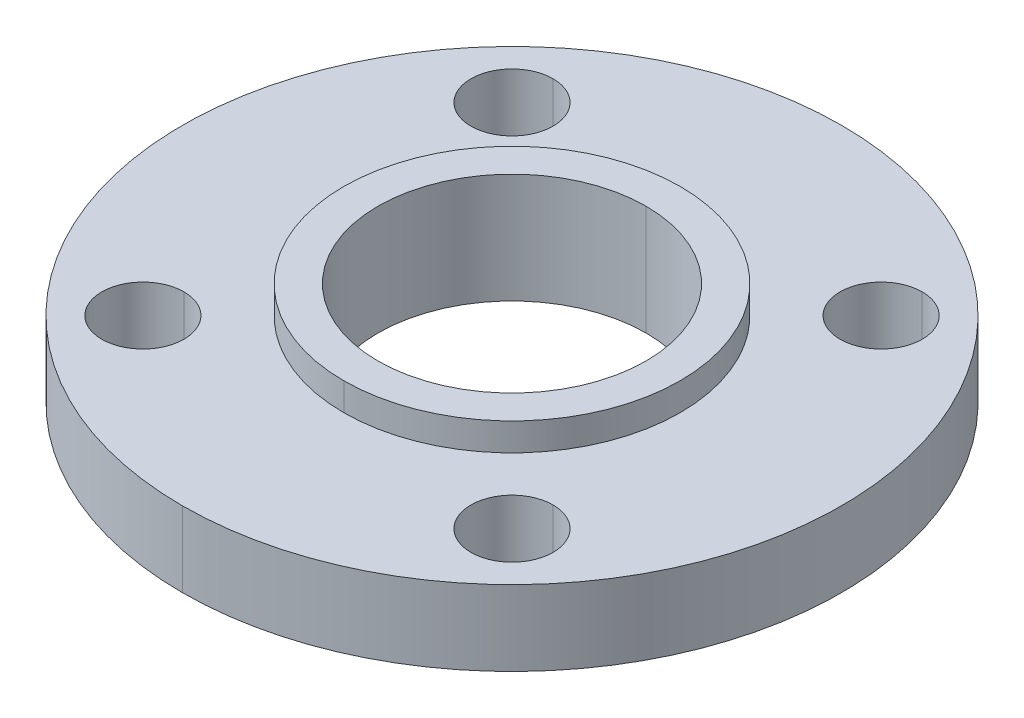
ISO-10303-21;
HEADER;
FILE_DESCRIPTION(('STEP AP214'),'2;1');
FILE_NAME('part.step','',(''),(''),'','','');
FILE_SCHEMA(('AUTOMOTIVE_DESIGN { 1 0 10303 214 1 1 1 1 }'));
ENDSEC;
DATA;
#1=APPLICATION_CONTEXT('core data for automotive mechanical design processes');
#2=APPLICATION_PROTOCOL_DEFINITION('international standard','automotive_design',2000,#1);
#3=PRODUCT_CONTEXT('',#1,'mechanical');
#4=PRODUCT('Part','Part','',(#3));
#5=PRODUCT_RELATED_PRODUCT_CATEGORY('part','',(#4));
#6=PRODUCT_DEFINITION_FORMATION('','',#4);
#7=PRODUCT_DEFINITION_CONTEXT('part definition',#1,'design');
#8=PRODUCT_DEFINITION('design','',#6,#7);
#9=PRODUCT_DEFINITION_SHAPE('','',#8);
#10=(LENGTH_UNIT() NAMED_UNIT(*) SI_UNIT(.MILLI.,.METRE.));
#11=(NAMED_UNIT(*) PLANE_ANGLE_UNIT() SI_UNIT($,.RADIAN.));
#12=(NAMED_UNIT(*) SI_UNIT($,.STERADIAN.) SOLID_ANGLE_UNIT());
#13=UNCERTAINTY_MEASURE_WITH_UNIT(LENGTH_MEASURE(1.E-05),#10,'distance_accuracy_value','');
#14=(GEOMETRIC_REPRESENTATION_CONTEXT(3) GLOBAL_UNCERTAINTY_ASSIGNED_CONTEXT((#13)) GLOBAL_UNIT_ASSIGNED_CONTEXT((#10,
#11,#12)) REPRESENTATION_CONTEXT('',''));
#15=CARTESIAN_POINT('',(0.,0.,0.));
#16=DIRECTION('',(0.,0.,1.));
#17=DIRECTION('',(1.,0.,0.));
#18=AXIS2_PLACEMENT_3D('',#15,#16,#17);
#19=CARTESIAN_POINT('',(-42.6738942446084,-12.7,-42.6738942446082));
#20=DIRECTION('',(0.,1.,0.));
#21=DIRECTION('',(0.,0.,1.));
#22=AXIS2_PLACEMENT_3D('',#19,#20,#21);
#23=CYLINDRICAL_SURFACE('',#22,9.5);
#24=DIRECTION('',(0.,1.,0.));
#25=VECTOR('',#24,1.);
#26=CARTESIAN_POINT('',(-42.6738942446083,-12.7,-52.1738942446082));
#27=LINE('',#26,#25);
#28=CARTESIAN_POINT('',(-42.6738942446084,-11.1,-52.1738942446086));
#29=VERTEX_POINT('',#28);
#30=CARTESIAN_POINT('',(-42.6738942446084,6.29999999999953,-52.1738942446076));
#31=VERTEX_POINT('',#30);
#32=EDGE_CURVE('E329',#29,#31,#27,.T.);
#33=ORIENTED_EDGE('',*,*,#32,.F.);
#34=CARTESIAN_POINT('',(-42.6738942446082,-11.1,-42.6738942446086));
#35=DIRECTION('',(0.,1.,0.));
#36=DIRECTION('',(0.,0.,1.));
#37=AXIS2_PLACEMENT_3D('',#34,#35,#36);
#38=CIRCLE('',#37,9.5);
#39=CARTESIAN_POINT('',(-42.6738942446083,-11.1,-33.1738942446086));
#40=VERTEX_POINT('',#39);
#41=EDGE_CURVE('E235',#40,#29,#38,.T.);
#42=ORIENTED_EDGE('',*,*,#41,.F.);
#43=DIRECTION('',(0.,1.,0.));
#44=VECTOR('',#43,1.);
#45=CARTESIAN_POINT('',(-42.6738942446084,-12.7,-33.1738942446082));
#46=LINE('',#45,#44);
#47=CARTESIAN_POINT('',(-42.6738942446084,6.29999999999953,-33.1738942446075));
#48=VERTEX_POINT('',#47);
#49=EDGE_CURVE('E249',#40,#48,#46,.T.);
#50=ORIENTED_EDGE('',*,*,#49,.T.);
#51=CARTESIAN_POINT('',(-42.6738942446082,6.29999999999953,-42.6738942446075));
#52=DIRECTION('',(0.,1.,0.));
#53=DIRECTION('',(1.,0.,0.));
#54=AXIS2_PLACEMENT_3D('',#51,#52,#53);
#55=CIRCLE('',#54,9.5);
#56=EDGE_CURVE('E240',#48,#31,#55,.T.);
#57=ORIENTED_EDGE('',*,*,#56,.T.);
#58=EDGE_LOOP('',(#33,#42,#50,#57));
#59=FACE_BOUND('',#58,.T.);
#60=ADVANCED_FACE('F17',(#59),#23,.F.);
#61=CARTESIAN_POINT('',(-42.6738942446078,-12.6999999999997,42.6738942446077));
#62=DIRECTION('',(0.,1.,0.));
#63=DIRECTION('',(0.,0.,1.));
#64=AXIS2_PLACEMENT_3D('',#61,#62,#63);
#65=CYLINDRICAL_SURFACE('',#64,9.5);
#66=DIRECTION('',(0.,1.,0.));
#67=VECTOR('',#66,1.);
#68=CARTESIAN_POINT('',(-42.6738942446078,-12.6999999999997,33.1738942446077));
#69=LINE('',#68,#67);
#70=CARTESIAN_POINT('',(-42.6738942446078,-11.0999999999999,33.1738942446075));
#71=VERTEX_POINT('',#70);
#72=CARTESIAN_POINT('',(-42.6738942446078,6.30000000000009,33.1738942446086));
#73=VERTEX_POINT('',#72);
#74=EDGE_CURVE('E207',#71,#73,#69,.T.);
#75=ORIENTED_EDGE('',*,*,#74,.F.);
#76=CARTESIAN_POINT('',(-42.6738942446078,-11.1,42.6738942446075));
#77=DIRECTION('',(0.,1.,0.));
#78=DIRECTION('',(0.,0.,1.));
#79=AXIS2_PLACEMENT_3D('',#76,#77,#78);
#80=CIRCLE('',#79,9.5);
#81=CARTESIAN_POINT('',(-42.6738942446078,-11.0999999999999,52.1738942446076));
#82=VERTEX_POINT('',#81);
#83=EDGE_CURVE('E320',#82,#71,#80,.T.);
#84=ORIENTED_EDGE('',*,*,#83,.F.);
#85=DIRECTION('',(0.,1.,0.));
#86=VECTOR('',#85,1.);
#87=CARTESIAN_POINT('',(-42.6738942446078,-12.6999999999997,52.1738942446077));
#88=LINE('',#87,#86);
#89=CARTESIAN_POINT('',(-42.6738942446078,6.30000000000008,52.1738942446086));
#90=VERTEX_POINT('',#89);
#91=EDGE_CURVE('E263',#82,#90,#88,.T.);
#92=ORIENTED_EDGE('',*,*,#91,.T.);
#93=CARTESIAN_POINT('',(-42.6738942446079,6.30000000000008,42.6738942446086));
#94=DIRECTION('',(0.,1.,0.));
#95=DIRECTION('',(0.,0.,-1.));
#96=AXIS2_PLACEMENT_3D('',#93,#94,#95);
#97=CIRCLE('',#96,9.5);
#98=EDGE_CURVE('E236',#90,#73,#97,.T.);
#99=ORIENTED_EDGE('',*,*,#98,.T.);
#100=EDGE_LOOP('',(#75,#84,#92,#99));
#101=FACE_BOUND('',#100,.T.);
#102=ADVANCED_FACE('F375',(#101),#65,.F.);
#103=CARTESIAN_POINT('',(42.6738942446087,-12.7000000000002,42.6738942446082));
#104=DIRECTION('',(0.,1.,0.));
#105=DIRECTION('',(0.,0.,1.));
#106=AXIS2_PLACEMENT_3D('',#103,#104,#105);
#107=CYLINDRICAL_SURFACE('',#106,9.5);
#108=DIRECTION('',(0.,1.,0.));
#109=VECTOR('',#108,1.);
#110=CARTESIAN_POINT('',(42.6738942446087,-12.7000000000002,33.1738942446082));
#111=LINE('',#110,#109);
#112=CARTESIAN_POINT('',(42.6738942446087,-11.1,33.1738942446083));
#113=VERTEX_POINT('',#112);
#114=CARTESIAN_POINT('',(42.6738942446087,6.30000000000031,33.1738942446083));
#115=VERTEX_POINT('',#114);
#116=EDGE_CURVE('E185',#113,#115,#111,.T.);
#117=ORIENTED_EDGE('',*,*,#116,.F.);
#118=CARTESIAN_POINT('',(42.6738942446087,-11.1,42.6738942446083));
#119=DIRECTION('',(0.,1.,0.));
#120=DIRECTION('',(0.,0.,1.));
#121=AXIS2_PLACEMENT_3D('',#118,#119,#120);
#122=CIRCLE('',#121,9.5);
#123=CARTESIAN_POINT('',(42.6738942446087,-11.1,52.1738942446083));
#124=VERTEX_POINT('',#123);
#125=EDGE_CURVE('E285',#124,#113,#122,.T.);
#126=ORIENTED_EDGE('',*,*,#125,.F.);
#127=DIRECTION('',(0.,1.,0.));
#128=VECTOR('',#127,1.);
#129=CARTESIAN_POINT('',(42.6738942446087,-12.7000000000001,52.1738942446082));
#130=LINE('',#129,#128);
#131=CARTESIAN_POINT('',(42.6738942446087,6.3000000000003,52.1738942446083));
#132=VERTEX_POINT('',#131);
#133=EDGE_CURVE('E226',#124,#132,#130,.T.);
#134=ORIENTED_EDGE('',*,*,#133,.T.);
#135=CARTESIAN_POINT('',(42.6738942446087,6.3000000000003,42.6738942446083));
#136=DIRECTION('',(0.,1.,0.));
#137=DIRECTION('',(-1.,0.,0.));
#138=AXIS2_PLACEMENT_3D('',#135,#136,#137);
#139=CIRCLE('',#138,9.5);
#140=EDGE_CURVE('E184',#132,#115,#139,.T.);
#141=ORIENTED_EDGE('',*,*,#140,.T.);
#142=EDGE_LOOP('',(#117,#126,#134,#141));
#143=FACE_BOUND('',#142,.T.);
#144=ADVANCED_FACE('F370',(#143),#107,.F.);
#145=CARTESIAN_POINT('',(42.6738942446079,-12.6999999999995,-42.6738942446074));
#146=DIRECTION('',(0.,1.,0.));
#147=DIRECTION('',(0.,0.,1.));
#148=AXIS2_PLACEMENT_3D('',#145,#146,#147);
#149=CYLINDRICAL_SURFACE('',#148,9.5);
#150=DIRECTION('',(0.,1.,0.));
#151=VECTOR('',#150,1.);
#152=CARTESIAN_POINT('',(42.6738942446079,-12.6999999999995,-52.1738942446073));
#153=LINE('',#152,#151);
#154=CARTESIAN_POINT('',(42.6738942446079,-11.0999999999994,-52.1738942446082));
#155=VERTEX_POINT('',#154);
#156=CARTESIAN_POINT('',(42.6738942446079,6.2999999999997,-52.1738942446079));
#157=VERTEX_POINT('',#156);
#158=EDGE_CURVE('E180',#155,#157,#153,.T.);
#159=ORIENTED_EDGE('',*,*,#158,.F.);
#160=CARTESIAN_POINT('',(42.6738942446079,-11.0999999999994,-42.6738942446082));
#161=DIRECTION('',(0.,1.,0.));
#162=DIRECTION('',(0.,0.,1.));
#163=AXIS2_PLACEMENT_3D('',#160,#161,#162);
#164=CIRCLE('',#163,9.5);
#165=CARTESIAN_POINT('',(42.6738942446079,-11.0999999999994,-33.1738942446082));
#166=VERTEX_POINT('',#165);
#167=EDGE_CURVE('E248',#166,#155,#164,.T.);
#168=ORIENTED_EDGE('',*,*,#167,.F.);
#169=DIRECTION('',(0.,1.,0.));
#170=VECTOR('',#169,1.);
#171=CARTESIAN_POINT('',(42.6738942446079,-12.6999999999995,-33.1738942446074));
#172=LINE('',#171,#170);
#173=CARTESIAN_POINT('',(42.6738942446077,6.2999999999997,-33.1738942446079));
#174=VERTEX_POINT('',#173);
#175=EDGE_CURVE('E176',#166,#174,#172,.T.);
#176=ORIENTED_EDGE('',*,*,#175,.T.);
#177=CARTESIAN_POINT('',(42.6738942446077,6.2999999999997,-42.6738942446079));
#178=DIRECTION('',(0.,1.,0.));
#179=DIRECTION('',(0.,0.,1.));
#180=AXIS2_PLACEMENT_3D('',#177,#178,#179);
#181=CIRCLE('',#180,9.5);
#182=EDGE_CURVE('E182',#174,#157,#181,.T.);
#183=ORIENTED_EDGE('',*,*,#182,.T.);
#184=EDGE_LOOP('',(#159,#168,#176,#183));
#185=FACE_BOUND('',#184,.T.);
#186=ADVANCED_FACE('F361',(#185),#149,.F.);
#187=CARTESIAN_POINT('',(31.,12.7000000000007,7.7715611723761E-13));
#188=DIRECTION('',(0.,-1.,0.));
#189=DIRECTION('',(0.,0.,-1.));
#190=AXIS2_PLACEMENT_3D('',#187,#188,#189);
#191=PLANE('',#190);
#192=CARTESIAN_POINT('',(0.,12.7000000000005,7.7715611723761E-13));
#193=DIRECTION('',(0.,1.,0.));
#194=DIRECTION('',(0.,0.,1.));
#195=AXIS2_PLACEMENT_3D('',#192,#193,#194);
#196=CIRCLE('',#195,31.);
#197=CARTESIAN_POINT('',(0.,12.7000000000005,31.0000000000008));
#198=VERTEX_POINT('',#197);
#199=CARTESIAN_POINT('',(0.,12.7000000000005,-30.9999999999992));
#200=VERTEX_POINT('',#199);
#201=EDGE_CURVE('E42',#198,#200,#196,.T.);
#202=ORIENTED_EDGE('',*,*,#201,.F.);
#203=CARTESIAN_POINT('',(0.,12.7000000000005,7.7715611723761E-13));
#204=DIRECTION('',(0.,1.,0.));
#205=DIRECTION('',(0.,0.,1.));
#206=AXIS2_PLACEMENT_3D('',#203,#204,#205);
#207=CIRCLE('',#206,31.);
#208=EDGE_CURVE('E191',#200,#198,#207,.T.);
#209=ORIENTED_EDGE('',*,*,#208,.F.);
#210=EDGE_LOOP('',(#202,#209));
#211=FACE_BOUND('',#210,.T.);
#212=CARTESIAN_POINT('',(0.,12.7000000000005,7.7715611723761E-13));
#213=DIRECTION('',(0.,1.,0.));
#214=DIRECTION('',(0.,0.,1.));
#215=AXIS2_PLACEMENT_3D('',#212,#213,#214);
#216=CIRCLE('',#215,38.9);
#217=CARTESIAN_POINT('',(0.,12.7000000000005,38.9000000000007));
#218=VERTEX_POINT('',#217);
#219=CARTESIAN_POINT('',(0.,12.7000000000005,-38.8999999999992));
#220=VERTEX_POINT('',#219);
#221=EDGE_CURVE('E161',#218,#220,#216,.T.);
#222=ORIENTED_EDGE('',*,*,#221,.T.);
#223=CARTESIAN_POINT('',(0.,12.7000000000005,7.7715611723761E-13));
#224=DIRECTION('',(0.,1.,0.));
#225=DIRECTION('',(0.,0.,1.));
#226=AXIS2_PLACEMENT_3D('',#223,#224,#225);
#227=CIRCLE('',#226,38.9);
#228=EDGE_CURVE('E11',#220,#218,#227,.T.);
#229=ORIENTED_EDGE('',*,*,#228,.T.);
#230=EDGE_LOOP('',(#222,#229));
#231=FACE_BOUND('',#230,.T.);
#232=ADVANCED_FACE('F162',(#211,#231),#191,.F.);
#233=CARTESIAN_POINT('',(0.,0.,0.));
#234=DIRECTION('',(0.,1.,0.));
#235=DIRECTION('',(0.,0.,1.));
#236=AXIS2_PLACEMENT_3D('',#233,#234,#235);
#237=CYLINDRICAL_SURFACE('',#236,38.9);
#238=DIRECTION('',(0.,1.,0.));
#239=VECTOR('',#238,1.);
#240=CARTESIAN_POINT('',(0.,0.,-38.9));
#241=LINE('',#240,#239);
#242=CARTESIAN_POINT('',(0.,6.29999999999977,-38.8999999999993));
#243=VERTEX_POINT('',#242);
#244=EDGE_CURVE('E155',#243,#220,#241,.T.);
#245=ORIENTED_EDGE('',*,*,#244,.F.);
#246=CARTESIAN_POINT('',(0.,6.29999999999975,6.66133814775094E-13));
#247=DIRECTION('',(0.,1.,0.));
#248=DIRECTION('',(0.,0.,1.));
#249=AXIS2_PLACEMENT_3D('',#246,#247,#248);
#250=CIRCLE('',#249,38.9);
#251=CARTESIAN_POINT('',(0.,6.29999999999977,38.9000000000007));
#252=VERTEX_POINT('',#251);
#253=EDGE_CURVE('E28',#243,#252,#250,.T.);
#254=ORIENTED_EDGE('',*,*,#253,.T.);
#255=DIRECTION('',(0.,1.,0.));
#256=VECTOR('',#255,1.);
#257=CARTESIAN_POINT('',(0.,0.,38.9));
#258=LINE('',#257,#256);
#259=EDGE_CURVE('E158',#252,#218,#258,.T.);
#260=ORIENTED_EDGE('',*,*,#259,.T.);
#261=ORIENTED_EDGE('',*,*,#228,.F.);
#262=EDGE_LOOP('',(#245,#254,#260,#261));
#263=FACE_BOUND('',#262,.T.);
#264=ADVANCED_FACE('F153',(#263),#237,.T.);
#265=CARTESIAN_POINT('',(38.9,6.2999999999992,5.55111512312578E-13));
#266=DIRECTION('',(0.,-1.,0.));
#267=DIRECTION('',(0.,0.,-1.));
#268=AXIS2_PLACEMENT_3D('',#265,#266,#267);
#269=PLANE('',#268);
#270=CARTESIAN_POINT('',(0.,6.29999999999975,6.66133814775094E-13));
#271=DIRECTION('',(0.,1.,0.));
#272=DIRECTION('',(0.,0.,1.));
#273=AXIS2_PLACEMENT_3D('',#270,#271,#272);
#274=CIRCLE('',#273,38.9);
#275=EDGE_CURVE('E168',#252,#243,#274,.T.);
#276=ORIENTED_EDGE('',*,*,#275,.F.);
#277=ORIENTED_EDGE('',*,*,#253,.F.);
#278=EDGE_LOOP('',(#276,#277));
#279=FACE_BOUND('',#278,.T.);
#280=ORIENTED_EDGE('',*,*,#182,.F.);
#281=CARTESIAN_POINT('',(42.6738942446077,6.2999999999997,-42.6738942446079));
#282=DIRECTION('',(0.,1.,0.));
#283=DIRECTION('',(0.,0.,1.));
#284=AXIS2_PLACEMENT_3D('',#281,#282,#283);
#285=CIRCLE('',#284,9.5);
#286=EDGE_CURVE('E295',#157,#174,#285,.T.);
#287=ORIENTED_EDGE('',*,*,#286,.F.);
#288=EDGE_LOOP('',(#280,#287));
#289=FACE_BOUND('',#288,.T.);
#290=ORIENTED_EDGE('',*,*,#140,.F.);
#291=CARTESIAN_POINT('',(42.6738942446087,6.3000000000003,42.6738942446083));
#292=DIRECTION('',(0.,1.,0.));
#293=DIRECTION('',(-1.,0.,0.));
#294=AXIS2_PLACEMENT_3D('',#291,#292,#293);
#295=CIRCLE('',#294,9.5);
#296=EDGE_CURVE('E189',#115,#132,#295,.T.);
#297=ORIENTED_EDGE('',*,*,#296,.F.);
#298=EDGE_LOOP('',(#290,#297));
#299=FACE_BOUND('',#298,.T.);
#300=ORIENTED_EDGE('',*,*,#98,.F.);
#301=CARTESIAN_POINT('',(-42.6738942446079,6.30000000000008,42.6738942446086));
#302=DIRECTION('',(0.,1.,0.));
#303=DIRECTION('',(0.,0.,-1.));
#304=AXIS2_PLACEMENT_3D('',#301,#302,#303);
#305=CIRCLE('',#304,9.5);
#306=EDGE_CURVE('E211',#73,#90,#305,.T.);
#307=ORIENTED_EDGE('',*,*,#306,.F.);
#308=EDGE_LOOP('',(#300,#307));
#309=FACE_BOUND('',#308,.T.);
#310=ORIENTED_EDGE('',*,*,#56,.F.);
#311=CARTESIAN_POINT('',(-42.6738942446082,6.29999999999953,-42.6738942446075));
#312=DIRECTION('',(0.,1.,0.));
#313=DIRECTION('',(1.,0.,0.));
#314=AXIS2_PLACEMENT_3D('',#311,#312,#313);
#315=CIRCLE('',#314,9.5);
#316=EDGE_CURVE('E253',#31,#48,#315,.T.);
#317=ORIENTED_EDGE('',*,*,#316,.F.);
#318=EDGE_LOOP('',(#310,#317));
#319=FACE_BOUND('',#318,.T.);
#320=CARTESIAN_POINT('',(0.,6.29999999999975,6.66133814775094E-13));
#321=DIRECTION('',(0.,1.,0.));
#322=DIRECTION('',(0.,0.,1.));
#323=AXIS2_PLACEMENT_3D('',#320,#321,#322);
#324=CIRCLE('',#323,76.2);
#325=CARTESIAN_POINT('',(0.,6.29999999999978,76.2));
#326=VERTEX_POINT('',#325);
#327=CARTESIAN_POINT('',(0.,6.29999999999978,-76.2));
#328=VERTEX_POINT('',#327);
#329=EDGE_CURVE('E231',#326,#328,#324,.T.);
#330=ORIENTED_EDGE('',*,*,#329,.T.);
#331=CARTESIAN_POINT('',(0.,6.29999999999975,6.66133814775094E-13));
#332=DIRECTION('',(0.,1.,0.));
#333=DIRECTION('',(0.,0.,1.));
#334=AXIS2_PLACEMENT_3D('',#331,#332,#333);
#335=CIRCLE('',#334,76.2);
#336=EDGE_CURVE('E245',#328,#326,#335,.T.);
#337=ORIENTED_EDGE('',*,*,#336,.T.);
#338=EDGE_LOOP('',(#330,#337));
#339=FACE_BOUND('',#338,.T.);
#340=ADVANCED_FACE('F368',(#279,#289,#299,#309,#319,#339),#269,.F.);
#341=CARTESIAN_POINT('',(0.,0.,0.));
#342=DIRECTION('',(0.,1.,0.));
#343=DIRECTION('',(0.,0.,1.));
#344=AXIS2_PLACEMENT_3D('',#341,#342,#343);
#345=CYLINDRICAL_SURFACE('',#344,76.2);
#346=DIRECTION('',(0.,1.,0.));
#347=VECTOR('',#346,1.);
#348=CARTESIAN_POINT('',(0.,0.,-76.2));
#349=LINE('',#348,#347);
#350=CARTESIAN_POINT('',(0.,-11.1000000000002,-76.2));
#351=VERTEX_POINT('',#350);
#352=EDGE_CURVE('E223',#351,#328,#349,.T.);
#353=ORIENTED_EDGE('',*,*,#352,.F.);
#354=CARTESIAN_POINT('',(0.,-11.1000000000002,-6.66133814775094E-13));
#355=DIRECTION('',(0.,1.,0.));
#356=DIRECTION('',(0.,0.,1.));
#357=AXIS2_PLACEMENT_3D('',#354,#355,#356);
#358=CIRCLE('',#357,76.2);
#359=CARTESIAN_POINT('',(0.,-11.1000000000002,76.2));
#360=VERTEX_POINT('',#359);
#361=EDGE_CURVE('E232',#351,#360,#358,.T.);
#362=ORIENTED_EDGE('',*,*,#361,.T.);
#363=DIRECTION('',(0.,1.,0.));
#364=VECTOR('',#363,1.);
#365=CARTESIAN_POINT('',(0.,0.,76.2));
#366=LINE('',#365,#364);
#367=EDGE_CURVE('E244',#360,#326,#366,.T.);
#368=ORIENTED_EDGE('',*,*,#367,.T.);
#369=ORIENTED_EDGE('',*,*,#336,.F.);
#370=EDGE_LOOP('',(#353,#362,#368,#369));
#371=FACE_BOUND('',#370,.T.);
#372=ADVANCED_FACE('F384',(#371),#345,.T.);
#373=CARTESIAN_POINT('',(46.05,-11.1,2.22044604925032E-13));
#374=DIRECTION('',(0.,1.,0.));
#375=DIRECTION('',(1.,0.,0.));
#376=AXIS2_PLACEMENT_3D('',#373,#374,#375);
#377=PLANE('',#376);
#378=CARTESIAN_POINT('',(0.,-11.1000000000002,-6.66133814775094E-13));
#379=DIRECTION('',(0.,1.,0.));
#380=DIRECTION('',(0.,0.,1.));
#381=AXIS2_PLACEMENT_3D('',#378,#379,#380);
#382=CIRCLE('',#381,46.05);
#383=CARTESIAN_POINT('',(0.,-11.1000000000002,46.0499999999993));
#384=VERTEX_POINT('',#383);
#385=CARTESIAN_POINT('',(0.,-11.1000000000002,-46.0500000000006));
#386=VERTEX_POINT('',#385);
#387=EDGE_CURVE('E218',#384,#386,#382,.T.);
#388=ORIENTED_EDGE('',*,*,#387,.T.);
#389=CARTESIAN_POINT('',(0.,-11.1000000000002,-6.66133814775094E-13));
#390=DIRECTION('',(0.,1.,0.));
#391=DIRECTION('',(0.,0.,1.));
#392=AXIS2_PLACEMENT_3D('',#389,#390,#391);
#393=CIRCLE('',#392,46.05);
#394=EDGE_CURVE('E204',#386,#384,#393,.T.);
#395=ORIENTED_EDGE('',*,*,#394,.T.);
#396=EDGE_LOOP('',(#388,#395));
#397=FACE_BOUND('',#396,.T.);
#398=ORIENTED_EDGE('',*,*,#167,.T.);
#399=CARTESIAN_POINT('',(42.6738942446079,-11.0999999999994,-42.6738942446082));
#400=DIRECTION('',(0.,1.,0.));
#401=DIRECTION('',(0.,0.,1.));
#402=AXIS2_PLACEMENT_3D('',#399,#400,#401);
#403=CIRCLE('',#402,9.5);
#404=EDGE_CURVE('E261',#155,#166,#403,.T.);
#405=ORIENTED_EDGE('',*,*,#404,.T.);
#406=EDGE_LOOP('',(#398,#405));
#407=FACE_BOUND('',#406,.T.);
#408=ORIENTED_EDGE('',*,*,#125,.T.);
#409=CARTESIAN_POINT('',(42.6738942446087,-11.1,42.6738942446083));
#410=DIRECTION('',(0.,1.,0.));
#411=DIRECTION('',(0.,0.,1.));
#412=AXIS2_PLACEMENT_3D('',#409,#410,#411);
#413=CIRCLE('',#412,9.5);
#414=EDGE_CURVE('E190',#113,#124,#413,.T.);
#415=ORIENTED_EDGE('',*,*,#414,.T.);
#416=EDGE_LOOP('',(#408,#415));
#417=FACE_BOUND('',#416,.T.);
#418=ORIENTED_EDGE('',*,*,#83,.T.);
#419=CARTESIAN_POINT('',(-42.6738942446078,-11.1,42.6738942446075));
#420=DIRECTION('',(0.,1.,0.));
#421=DIRECTION('',(0.,0.,1.));
#422=AXIS2_PLACEMENT_3D('',#419,#420,#421);
#423=CIRCLE('',#422,9.5);
#424=EDGE_CURVE('E212',#71,#82,#423,.T.);
#425=ORIENTED_EDGE('',*,*,#424,.T.);
#426=EDGE_LOOP('',(#418,#425));
#427=FACE_BOUND('',#426,.T.);
#428=ORIENTED_EDGE('',*,*,#41,.T.);
#429=CARTESIAN_POINT('',(-42.6738942446082,-11.1,-42.6738942446086));
#430=DIRECTION('',(0.,1.,0.));
#431=DIRECTION('',(0.,0.,1.));
#432=AXIS2_PLACEMENT_3D('',#429,#430,#431);
#433=CIRCLE('',#432,9.5);
#434=EDGE_CURVE('E21',#29,#40,#433,.T.);
#435=ORIENTED_EDGE('',*,*,#434,.T.);
#436=EDGE_LOOP('',(#428,#435));
#437=FACE_BOUND('',#436,.T.);
#438=CARTESIAN_POINT('',(0.,-11.1000000000002,-6.66133814775094E-13));
#439=DIRECTION('',(0.,1.,0.));
#440=DIRECTION('',(0.,0.,1.));
#441=AXIS2_PLACEMENT_3D('',#438,#439,#440);
#442=CIRCLE('',#441,76.2);
#443=EDGE_CURVE('E219',#360,#351,#442,.T.);
#444=ORIENTED_EDGE('',*,*,#443,.F.);
#445=ORIENTED_EDGE('',*,*,#361,.F.);
#446=EDGE_LOOP('',(#444,#445));
#447=FACE_BOUND('',#446,.T.);
#448=ADVANCED_FACE('F408',(#397,#407,#417,#427,#437,#447),#377,.F.);
#449=CARTESIAN_POINT('',(0.,0.,0.));
#450=DIRECTION('',(0.,1.,0.));
#451=DIRECTION('',(0.,0.,1.));
#452=AXIS2_PLACEMENT_3D('',#449,#450,#451);
#453=CYLINDRICAL_SURFACE('',#452,46.05);
#454=DIRECTION('',(0.,1.,0.));
#455=VECTOR('',#454,1.);
#456=CARTESIAN_POINT('',(0.,0.,-46.05));
#457=LINE('',#456,#455);
#458=CARTESIAN_POINT('',(0.,-12.6999999999997,-46.0500000000006));
#459=VERTEX_POINT('',#458);
#460=EDGE_CURVE('E327',#459,#386,#457,.T.);
#461=ORIENTED_EDGE('',*,*,#460,.F.);
#462=CARTESIAN_POINT('',(0.,-12.6999999999997,-6.66133814775094E-13));
#463=DIRECTION('',(0.,1.,0.));
#464=DIRECTION('',(0.,0.,1.));
#465=AXIS2_PLACEMENT_3D('',#462,#463,#464);
#466=CIRCLE('',#465,46.05);
#467=CARTESIAN_POINT('',(0.,-12.6999999999997,46.0499999999993));
#468=VERTEX_POINT('',#467);
#469=EDGE_CURVE('E200',#459,#468,#466,.T.);
#470=ORIENTED_EDGE('',*,*,#469,.T.);
#471=DIRECTION('',(0.,1.,0.));
#472=VECTOR('',#471,1.);
#473=CARTESIAN_POINT('',(0.,0.,46.05));
#474=LINE('',#473,#472);
#475=EDGE_CURVE('E213',#468,#384,#474,.T.);
#476=ORIENTED_EDGE('',*,*,#475,.T.);
#477=ORIENTED_EDGE('',*,*,#394,.F.);
#478=EDGE_LOOP('',(#461,#470,#476,#477));
#479=FACE_BOUND('',#478,.T.);
#480=ADVANCED_FACE('F413',(#479),#453,.T.);
#481=CARTESIAN_POINT('',(31.,-12.6999999999997,2.22044604925032E-13));
#482=DIRECTION('',(0.,1.,0.));
#483=DIRECTION('',(1.,0.,0.));
#484=AXIS2_PLACEMENT_3D('',#481,#482,#483);
#485=PLANE('',#484);
#486=CARTESIAN_POINT('',(0.,-12.6999999999997,-6.66133814775094E-13));
#487=DIRECTION('',(0.,1.,0.));
#488=DIRECTION('',(0.,0.,1.));
#489=AXIS2_PLACEMENT_3D('',#486,#487,#488);
#490=CIRCLE('',#489,31.);
#491=CARTESIAN_POINT('',(0.,-12.6999999999997,30.9999999999993));
#492=VERTEX_POINT('',#491);
#493=CARTESIAN_POINT('',(0.,-12.6999999999997,-31.0000000000007));
#494=VERTEX_POINT('',#493);
#495=EDGE_CURVE('E197',#492,#494,#490,.T.);
#496=ORIENTED_EDGE('',*,*,#495,.T.);
#497=CARTESIAN_POINT('',(0.,-12.6999999999997,-6.66133814775094E-13));
#498=DIRECTION('',(0.,1.,0.));
#499=DIRECTION('',(0.,0.,1.));
#500=AXIS2_PLACEMENT_3D('',#497,#498,#499);
#501=CIRCLE('',#500,31.);
#502=EDGE_CURVE('E217',#494,#492,#501,.T.);
#503=ORIENTED_EDGE('',*,*,#502,.T.);
#504=EDGE_LOOP('',(#496,#503));
#505=FACE_BOUND('',#504,.T.);
#506=CARTESIAN_POINT('',(0.,-12.6999999999997,-6.66133814775094E-13));
#507=DIRECTION('',(0.,1.,0.));
#508=DIRECTION('',(0.,0.,1.));
#509=AXIS2_PLACEMENT_3D('',#506,#507,#508);
#510=CIRCLE('',#509,46.05);
#511=EDGE_CURVE('E257',#468,#459,#510,.T.);
#512=ORIENTED_EDGE('',*,*,#511,.F.);
#513=ORIENTED_EDGE('',*,*,#469,.F.);
#514=EDGE_LOOP('',(#512,#513));
#515=FACE_BOUND('',#514,.T.);
#516=ADVANCED_FACE('F353',(#505,#515),#485,.F.);
#517=CARTESIAN_POINT('',(0.,0.,0.));
#518=DIRECTION('',(0.,1.,0.));
#519=DIRECTION('',(0.,0.,1.));
#520=AXIS2_PLACEMENT_3D('',#517,#518,#519);
#521=CYLINDRICAL_SURFACE('',#520,31.);
#522=DIRECTION('',(0.,1.,0.));
#523=VECTOR('',#522,1.);
#524=CARTESIAN_POINT('',(0.,0.,-31.));
#525=LINE('',#524,#523);
#526=EDGE_CURVE('E196',#494,#200,#525,.T.);
#527=ORIENTED_EDGE('',*,*,#526,.F.);
#528=ORIENTED_EDGE('',*,*,#495,.F.);
#529=DIRECTION('',(0.,1.,0.));
#530=VECTOR('',#529,1.);
#531=CARTESIAN_POINT('',(0.,0.,31.));
#532=LINE('',#531,#530);
#533=EDGE_CURVE('E195',#492,#198,#532,.T.);
#534=ORIENTED_EDGE('',*,*,#533,.T.);
#535=ORIENTED_EDGE('',*,*,#201,.T.);
#536=EDGE_LOOP('',(#527,#528,#534,#535));
#537=FACE_BOUND('',#536,.T.);
#538=ADVANCED_FACE('F359',(#537),#521,.F.);
#539=CARTESIAN_POINT('',(0.,0.,0.));
#540=DIRECTION('',(0.,1.,0.));
#541=DIRECTION('',(0.,0.,1.));
#542=AXIS2_PLACEMENT_3D('',#539,#540,#541);
#543=CYLINDRICAL_SURFACE('',#542,31.);
#544=ORIENTED_EDGE('',*,*,#502,.F.);
#545=ORIENTED_EDGE('',*,*,#526,.T.);
#546=ORIENTED_EDGE('',*,*,#208,.T.);
#547=ORIENTED_EDGE('',*,*,#533,.F.);
#548=EDGE_LOOP('',(#544,#545,#546,#547));
#549=FACE_BOUND('',#548,.T.);
#550=ADVANCED_FACE('F19',(#549),#543,.F.);
#551=CARTESIAN_POINT('',(0.,0.,0.));
#552=DIRECTION('',(0.,1.,0.));
#553=DIRECTION('',(0.,0.,1.));
#554=AXIS2_PLACEMENT_3D('',#551,#552,#553);
#555=CYLINDRICAL_SURFACE('',#554,46.05);
#556=ORIENTED_EDGE('',*,*,#511,.T.);
#557=ORIENTED_EDGE('',*,*,#460,.T.);
#558=ORIENTED_EDGE('',*,*,#387,.F.);
#559=ORIENTED_EDGE('',*,*,#475,.F.);
#560=EDGE_LOOP('',(#556,#557,#558,#559));
#561=FACE_BOUND('',#560,.T.);
#562=ADVANCED_FACE('F424',(#561),#555,.T.);
#563=CARTESIAN_POINT('',(0.,0.,0.));
#564=DIRECTION('',(0.,1.,0.));
#565=DIRECTION('',(0.,0.,1.));
#566=AXIS2_PLACEMENT_3D('',#563,#564,#565);
#567=CYLINDRICAL_SURFACE('',#566,76.2);
#568=ORIENTED_EDGE('',*,*,#443,.T.);
#569=ORIENTED_EDGE('',*,*,#352,.T.);
#570=ORIENTED_EDGE('',*,*,#329,.F.);
#571=ORIENTED_EDGE('',*,*,#367,.F.);
#572=EDGE_LOOP('',(#568,#569,#570,#571));
#573=FACE_BOUND('',#572,.T.);
#574=ADVANCED_FACE('F429',(#573),#567,.T.);
#575=CARTESIAN_POINT('',(0.,0.,0.));
#576=DIRECTION('',(0.,1.,0.));
#577=DIRECTION('',(0.,0.,1.));
#578=AXIS2_PLACEMENT_3D('',#575,#576,#577);
#579=CYLINDRICAL_SURFACE('',#578,38.9);
#580=ORIENTED_EDGE('',*,*,#275,.T.);
#581=ORIENTED_EDGE('',*,*,#244,.T.);
#582=ORIENTED_EDGE('',*,*,#221,.F.);
#583=ORIENTED_EDGE('',*,*,#259,.F.);
#584=EDGE_LOOP('',(#580,#581,#582,#583));
#585=FACE_BOUND('',#584,.T.);
#586=ADVANCED_FACE('F166',(#585),#579,.T.);
#587=CARTESIAN_POINT('',(42.6738942446079,-12.6999999999995,-42.6738942446074));
#588=DIRECTION('',(0.,1.,0.));
#589=DIRECTION('',(0.,0.,1.));
#590=AXIS2_PLACEMENT_3D('',#587,#588,#589);
#591=CYLINDRICAL_SURFACE('',#590,9.5);
#592=ORIENTED_EDGE('',*,*,#404,.F.);
#593=ORIENTED_EDGE('',*,*,#158,.T.);
#594=ORIENTED_EDGE('',*,*,#286,.T.);
#595=ORIENTED_EDGE('',*,*,#175,.F.);
#596=EDGE_LOOP('',(#592,#593,#594,#595));
#597=FACE_BOUND('',#596,.T.);
#598=ADVANCED_FACE('F470',(#597),#591,.F.);
#599=CARTESIAN_POINT('',(42.6738942446087,-12.7000000000002,42.6738942446082));
#600=DIRECTION('',(0.,1.,0.));
#601=DIRECTION('',(0.,0.,1.));
#602=AXIS2_PLACEMENT_3D('',#599,#600,#601);
#603=CYLINDRICAL_SURFACE('',#602,9.5);
#604=ORIENTED_EDGE('',*,*,#414,.F.);
#605=ORIENTED_EDGE('',*,*,#116,.T.);
#606=ORIENTED_EDGE('',*,*,#296,.T.);
#607=ORIENTED_EDGE('',*,*,#133,.F.);
#608=EDGE_LOOP('',(#604,#605,#606,#607));
#609=FACE_BOUND('',#608,.T.);
#610=ADVANCED_FACE('F393',(#609),#603,.F.);
#611=CARTESIAN_POINT('',(-42.6738942446078,-12.6999999999997,42.6738942446077));
#612=DIRECTION('',(0.,1.,0.));
#613=DIRECTION('',(0.,0.,1.));
#614=AXIS2_PLACEMENT_3D('',#611,#612,#613);
#615=CYLINDRICAL_SURFACE('',#614,9.5);
#616=ORIENTED_EDGE('',*,*,#424,.F.);
#617=ORIENTED_EDGE('',*,*,#74,.T.);
#618=ORIENTED_EDGE('',*,*,#306,.T.);
#619=ORIENTED_EDGE('',*,*,#91,.F.);
#620=EDGE_LOOP('',(#616,#617,#618,#619));
#621=FACE_BOUND('',#620,.T.);
#622=ADVANCED_FACE('F388',(#621),#615,.F.);
#623=CARTESIAN_POINT('',(-42.6738942446084,-12.7,-42.6738942446082));
#624=DIRECTION('',(0.,1.,0.));
#625=DIRECTION('',(0.,0.,1.));
#626=AXIS2_PLACEMENT_3D('',#623,#624,#625);
#627=CYLINDRICAL_SURFACE('',#626,9.5);
#628=ORIENTED_EDGE('',*,*,#434,.F.);
#629=ORIENTED_EDGE('',*,*,#32,.T.);
#630=ORIENTED_EDGE('',*,*,#316,.T.);
#631=ORIENTED_EDGE('',*,*,#49,.F.);
#632=EDGE_LOOP('',(#628,#629,#630,#631));
#633=FACE_BOUND('',#632,.T.);
#634=ADVANCED_FACE('F386',(#633),#627,.F.);
#635=CLOSED_SHELL('',(#60,#102,#144,#186,#232,#264,#340,#372,#448,#480,#516,#538,#550,#562,#574,
#586,#598,#610,#622,#634));
#636=MANIFOLD_SOLID_BREP('B1',#635);
#637=ADVANCED_BREP_SHAPE_REPRESENTATION('',(#18,#636),#14);
#638=SHAPE_DEFINITION_REPRESENTATION(#9,#637);
ENDSEC;
END-ISO-10303-21;
